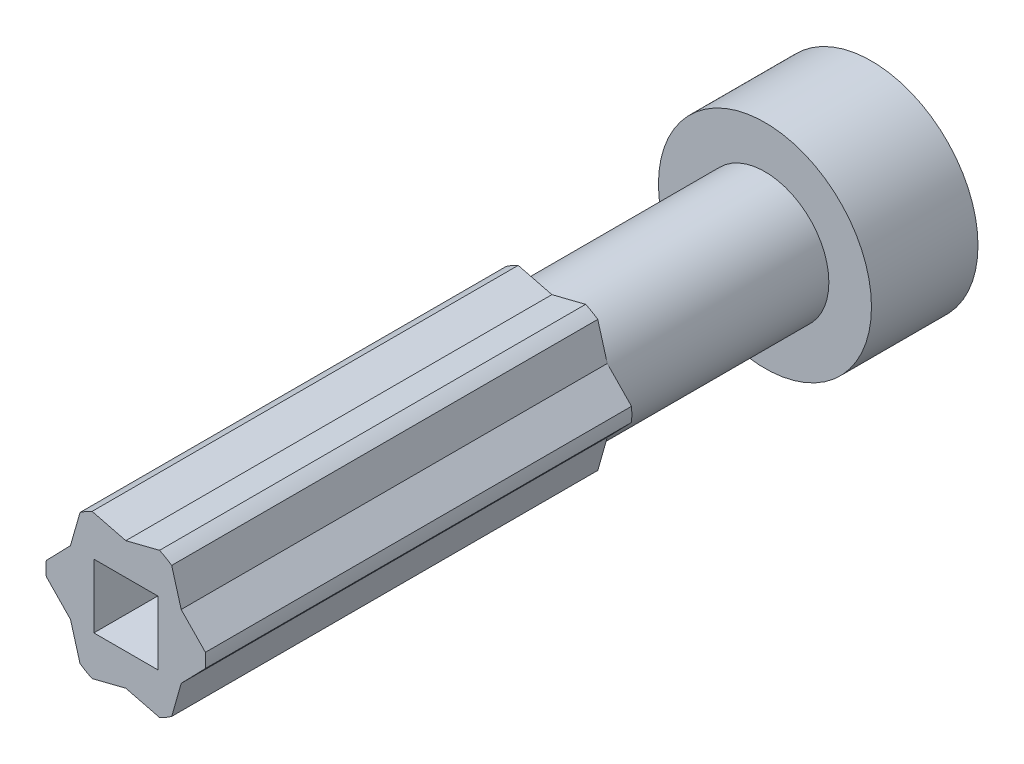
ISO-10303-21;
HEADER;
FILE_DESCRIPTION(('STEP AP214'),'2;1');
FILE_NAME('part.step','',(''),(''),'','','');
FILE_SCHEMA(('AUTOMOTIVE_DESIGN { 1 0 10303 214 1 1 1 1 }'));
ENDSEC;
DATA;
#1=APPLICATION_CONTEXT('core data for automotive mechanical design processes');
#2=APPLICATION_PROTOCOL_DEFINITION('international standard','automotive_design',2000,#1);
#3=PRODUCT_CONTEXT('',#1,'mechanical');
#4=PRODUCT('Part','Part','',(#3));
#5=PRODUCT_RELATED_PRODUCT_CATEGORY('part','',(#4));
#6=PRODUCT_DEFINITION_FORMATION('','',#4);
#7=PRODUCT_DEFINITION_CONTEXT('part definition',#1,'design');
#8=PRODUCT_DEFINITION('design','',#6,#7);
#9=PRODUCT_DEFINITION_SHAPE('','',#8);
#10=(LENGTH_UNIT() NAMED_UNIT(*) SI_UNIT(.MILLI.,.METRE.));
#11=(NAMED_UNIT(*) PLANE_ANGLE_UNIT() SI_UNIT($,.RADIAN.));
#12=(NAMED_UNIT(*) SI_UNIT($,.STERADIAN.) SOLID_ANGLE_UNIT());
#13=UNCERTAINTY_MEASURE_WITH_UNIT(LENGTH_MEASURE(1.E-05),#10,'distance_accuracy_value','');
#14=(GEOMETRIC_REPRESENTATION_CONTEXT(3) GLOBAL_UNCERTAINTY_ASSIGNED_CONTEXT((#13)) GLOBAL_UNIT_ASSIGNED_CONTEXT((#10,
#11,#12)) REPRESENTATION_CONTEXT('',''));
#15=CARTESIAN_POINT('',(0.,0.,0.));
#16=DIRECTION('',(0.,0.,1.));
#17=DIRECTION('',(1.,0.,0.));
#18=AXIS2_PLACEMENT_3D('',#15,#16,#17);
#19=CARTESIAN_POINT('',(0.,0.,38.1));
#20=DIRECTION('',(0.,0.,-1.));
#21=DIRECTION('',(-1.,0.,0.));
#22=AXIS2_PLACEMENT_3D('',#19,#20,#21);
#23=CYLINDRICAL_SURFACE('',#22,3.81);
#24=CARTESIAN_POINT('',(-3.81000000000001,0.,4.7625));
#25=CARTESIAN_POINT('',(-3.80999312126421,-0.0850367268480943,4.76249084953406));
#26=CARTESIAN_POINT('',(-3.80712005877877,-0.170207174271141,4.75562681266925));
#27=CARTESIAN_POINT('',(-3.79590495046034,-0.338134161368688,4.72841438755136));
#28=CARTESIAN_POINT('',(-3.78754863394308,-0.420883812058091,4.70803081193042));
#29=CARTESIAN_POINT('',(-3.76626487078422,-0.581264691739586,4.65466291343867));
#30=CARTESIAN_POINT('',(-3.75335291968253,-0.658912226021491,4.62172127537543));
#31=CARTESIAN_POINT('',(-3.72421513817741,-0.807503790983442,4.54434851449461));
#32=CARTESIAN_POINT('',(-3.70799031187918,-0.878449843320334,4.49992087190698));
#33=CARTESIAN_POINT('',(-3.67293942006872,-1.01529947252067,4.39848119210958));
#34=CARTESIAN_POINT('',(-3.65402816724135,-1.08082240974766,4.34098533783701));
#35=CARTESIAN_POINT('',(-3.61610546867011,-1.20162297278599,4.21606429482612));
#36=CARTESIAN_POINT('',(-3.59709397555649,-1.25689520420451,4.14863391138396));
#37=CARTESIAN_POINT('',(-3.56007697702505,-1.35831246875283,4.00173599249257));
#38=CARTESIAN_POINT('',(-3.54216699329197,-1.40387461355495,3.92183944049829));
#39=CARTESIAN_POINT('',(-3.51073176893393,-1.48074304547866,3.75466196244043));
#40=CARTESIAN_POINT('',(-3.49720427051045,-1.51205667662092,3.66738486805474));
#41=CARTESIAN_POINT('',(-3.47698765342383,-1.55796739856445,3.49230481145473));
#42=CARTESIAN_POINT('',(-3.47000052317766,-1.57329705504567,3.40472968609196));
#43=CARTESIAN_POINT('',(-3.46279884298767,-1.58909016659113,3.22799291828805));
#44=CARTESIAN_POINT('',(-3.4625805580008,-1.58956182029095,3.1388321779673));
#45=CARTESIAN_POINT('',(-3.46868901842282,-1.57617731961875,2.96875192324762));
#46=CARTESIAN_POINT('',(-3.47451531058997,-1.56341675012632,2.88772460736313));
#47=CARTESIAN_POINT('',(-3.49121073122718,-1.52576772590046,2.7290876444295));
#48=CARTESIAN_POINT('',(-3.50208082543526,-1.50087694854724,2.65147865500545));
#49=CARTESIAN_POINT('',(-3.52788454661402,-1.43918887584025,2.49992171720087));
#50=CARTESIAN_POINT('',(-3.54289972075401,-1.4021494885484,2.42608681544));
#51=CARTESIAN_POINT('',(-3.57528280549176,-1.31738678077324,2.2853932779722));
#52=CARTESIAN_POINT('',(-3.59265164284819,-1.26965924695992,2.21853740872083));
#53=CARTESIAN_POINT('',(-3.62957080635033,-1.16013987624077,2.08775305240928));
#54=CARTESIAN_POINT('',(-3.64918144183679,-1.09750032367365,2.02454945942046));
#55=CARTESIAN_POINT('',(-3.68713604852911,-0.962316580635479,1.90930085124181));
#56=CARTESIAN_POINT('',(-3.70547972233803,-0.889770076499569,1.85725844995092));
#57=CARTESIAN_POINT('',(-3.73936620116719,-0.734628894840602,1.76474650400733));
#58=CARTESIAN_POINT('',(-3.75483458510028,-0.651840939708585,1.7245718046586));
#59=CARTESIAN_POINT('',(-3.78065641396805,-0.479872551209143,1.65897415270382));
#60=CARTESIAN_POINT('',(-3.79101268524186,-0.390695681389777,1.63354304743134));
#61=CARTESIAN_POINT('',(-3.80491544306725,-0.214538703949805,1.59967168999916));
#62=CARTESIAN_POINT('',(-3.80885117129848,-0.127776332303962,1.59025862104642));
#63=CARTESIAN_POINT('',(-3.81071183968306,0.0461704124799492,1.58579029601008));
#64=CARTESIAN_POINT('',(-3.8086385055418,0.133354657283765,1.59073091777995));
#65=CARTESIAN_POINT('',(-3.79896646424336,0.301114767773541,1.6141332777037));
#66=CARTESIAN_POINT('',(-3.79164706850677,0.381803867631939,1.63191184170343));
#67=CARTESIAN_POINT('',(-3.77251730600958,0.538966091193194,1.67953460706678));
#68=CARTESIAN_POINT('',(-3.76070637188808,0.615438680878219,1.70938033275687));
#69=CARTESIAN_POINT('',(-3.73327003719348,0.764678429833711,1.78126513915438));
#70=CARTESIAN_POINT('',(-3.71753754165985,0.837256690806187,1.82365419259545));
#71=CARTESIAN_POINT('',(-3.68393731815449,0.974529694613838,1.91903778979545));
#72=CARTESIAN_POINT('',(-3.66606869996292,1.03922112780437,1.97203676144218));
#73=CARTESIAN_POINT('',(-3.62854351627205,1.16374345644821,2.09156710625596));
#74=CARTESIAN_POINT('',(-3.60885043520608,1.22289658643431,2.15879489879255));
#75=CARTESIAN_POINT('',(-3.57104107695369,1.32927070455392,2.30253702043795));
#76=CARTESIAN_POINT('',(-3.55292515846669,1.37648898292725,2.37905345266811));
#77=CARTESIAN_POINT('',(-3.52020360529865,1.45816269465038,2.54078000263427));
#78=CARTESIAN_POINT('',(-3.50565164444989,1.49242676161398,2.62609842510383));
#79=CARTESIAN_POINT('',(-3.48244611686883,1.54581115718489,2.80209065413882));
#80=CARTESIAN_POINT('',(-3.47378768735825,1.56494397276875,2.89275997835385));
#81=CARTESIAN_POINT('',(-3.46409218962342,1.58628182043094,3.069359747983));
#82=CARTESIAN_POINT('',(-3.46251975728299,1.58967653124663,3.15511772111162));
#83=CARTESIAN_POINT('',(-3.46575193324004,1.58261780915361,3.3259304336492));
#84=CARTESIAN_POINT('',(-3.47055556256207,1.57216650215195,3.41098527899839));
#85=CARTESIAN_POINT('',(-3.48550930153897,1.53871174071222,3.57389778928549));
#86=CARTESIAN_POINT('',(-3.49540010655033,1.51631527535753,3.65190617529851));
#87=CARTESIAN_POINT('',(-3.51921040122973,1.46019936816699,3.80307598712368));
#88=CARTESIAN_POINT('',(-3.53313102277267,1.42647674466902,3.87623604405646));
#89=CARTESIAN_POINT('',(-3.56447032291236,1.34633063138065,4.02043378785539));
#90=CARTESIAN_POINT('',(-3.58204900446381,1.29926538356304,4.09107935931373));
#91=CARTESIAN_POINT('',(-3.61827685098373,1.19466877224048,4.22384237698807));
#92=CARTESIAN_POINT('',(-3.63692638559259,1.13713377971004,4.28595685301273));
#93=CARTESIAN_POINT('',(-3.67482618919634,1.00825559813903,4.40454882573961));
#94=CARTESIAN_POINT('',(-3.69402128239975,0.936211919735194,4.46028626970758));
#95=CARTESIAN_POINT('',(-3.72948382399967,0.783082100651522,4.55891830600037));
#96=CARTESIAN_POINT('',(-3.74574993694262,0.701991862391085,4.60180704590974));
#97=CARTESIAN_POINT('',(-3.77328662870322,0.534329712031779,4.67259650370867));
#98=CARTESIAN_POINT('',(-3.78463533879085,0.447870568545354,4.70073325360396));
#99=CARTESIAN_POINT('',(-3.80137682406163,0.271031235745041,4.74180703792882));
#100=CARTESIAN_POINT('',(-3.80678824381231,0.180664252565729,4.75479166201294));
#101=CARTESIAN_POINT('',(-3.80964805212561,0.0599898240372968,4.76165311457979));
#102=CARTESIAN_POINT('',(-3.81000242700227,0.030003235238051,4.76250322852952));
#103=CARTESIAN_POINT('',(-3.81000000000001,0.,4.7625));
#104=B_SPLINE_CURVE_WITH_KNOTS('',3,(#24,#25,#26,#27,#28,#29,#30,#31,#32,#33,#34,#35,#36,#37,
#38,#39,#40,#41,#42,#43,#44,#45,#46,#47,#48,#49,#50,#51,#52,#53,#54,#55,#56,#57,#58,#59,#60,#61,
#62,#63,#64,#65,#66,#67,#68,#69,#70,#71,#72,#73,#74,#75,#76,#77,#78,#79,#80,#81,#82,#83,#84,#85,
#86,#87,#88,#89,#90,#91,#92,#93,#94,#95,#96,#97,#98,#99,#100,#101,#102,#103),.UNSPECIFIED.,.T.,
.F.,(4,2,2,2,2,2,2,2,2,2,2,2,2,2,2,2,2,2,2,2,2,2,2,2,2,2,2,2,2,2,2,2,2,2,2,2,2,2,2,4),(0.,
0.255024786982704,0.51071594659862,0.765545651921126,1.02029823480337,1.28673779086796,
1.55331716426972,1.83301290164697,2.11256431347854,2.37864996884707,2.64458879576298,
2.89014099647255,3.13574023253568,3.38656565584576,3.63749013060861,3.90962059232441,
4.18181471629543,4.46029149927247,4.73861414757248,4.9993352310944,5.25998144716339,
5.50769268964378,5.75543523284281,6.01087361795658,6.26641882946272,6.54022679797216,
6.81409687775246,7.09186781216606,7.36940927784728,7.62558644500758,7.88172428347881,
8.12593815455259,8.37022068587291,8.62919144614762,8.88825214250958,9.16618099456213,
9.44423624774301,9.71769526890627,9.9902930809605,10.0802726575386),.UNSPECIFIED.);
#105=CARTESIAN_POINT('',(-3.81000000000001,0.,4.7625));
#106=VERTEX_POINT('',#105);
#107=EDGE_CURVE('E347',#106,#106,#104,.T.);
#108=ORIENTED_EDGE('',*,*,#107,.T.);
#109=EDGE_LOOP('',(#108));
#110=FACE_BOUND('',#109,.T.);
#111=CARTESIAN_POINT('',(0.,0.,12.7));
#112=DIRECTION('',(0.,0.,1.));
#113=DIRECTION('',(1.,0.,0.));
#114=AXIS2_PLACEMENT_3D('',#111,#112,#113);
#115=CIRCLE('',#114,3.81);
#116=CARTESIAN_POINT('',(-3.29709075963902,-1.90926491684748,12.7));
#117=VERTEX_POINT('',#116);
#118=CARTESIAN_POINT('',(0.00199791969690555,-3.80999947615707,12.7));
#119=VERTEX_POINT('',#118);
#120=EDGE_CURVE('E145',#117,#119,#115,.T.);
#121=ORIENTED_EDGE('',*,*,#120,.F.);
#122=DIRECTION('',(0.,0.,1.));
#123=VECTOR('',#122,1.);
#124=CARTESIAN_POINT('',(-3.29709075963902,-1.90926491684748,12.7));
#125=LINE('',#124,#123);
#126=CARTESIAN_POINT('',(-3.29709075963902,-1.90926491684749,38.1));
#127=VERTEX_POINT('',#126);
#128=EDGE_CURVE('E149',#117,#127,#125,.T.);
#129=ORIENTED_EDGE('',*,*,#128,.T.);
#130=CARTESIAN_POINT('',(0.,0.,38.1));
#131=DIRECTION('',(0.,0.,1.));
#132=DIRECTION('',(1.,0.,0.));
#133=AXIS2_PLACEMENT_3D('',#130,#131,#132);
#134=CIRCLE('',#133,3.81);
#135=CARTESIAN_POINT('',(-3.30052497881844,-1.90332206002987,38.1));
#136=VERTEX_POINT('',#135);
#137=EDGE_CURVE('E138',#136,#127,#134,.T.);
#138=ORIENTED_EDGE('',*,*,#137,.F.);
#139=DIRECTION('',(0.,0.,1.));
#140=VECTOR('',#139,1.);
#141=CARTESIAN_POINT('',(-3.30052497881836,-1.90332206002987,12.7));
#142=LINE('',#141,#140);
#143=CARTESIAN_POINT('',(-3.30052497881836,-1.90332206002987,12.7));
#144=VERTEX_POINT('',#143);
#145=EDGE_CURVE('E379',#144,#136,#142,.T.);
#146=ORIENTED_EDGE('',*,*,#145,.F.);
#147=CARTESIAN_POINT('',(0.,0.,12.7));
#148=DIRECTION('',(0.,0.,1.));
#149=DIRECTION('',(1.,0.,0.));
#150=AXIS2_PLACEMENT_3D('',#147,#148,#149);
#151=CIRCLE('',#150,3.81);
#152=CARTESIAN_POINT('',(-3.30152059995389,1.90159452252039,12.7));
#153=VERTEX_POINT('',#152);
#154=EDGE_CURVE('E360',#153,#144,#151,.T.);
#155=ORIENTED_EDGE('',*,*,#154,.F.);
#156=DIRECTION('',(0.,0.,1.));
#157=VECTOR('',#156,1.);
#158=CARTESIAN_POINT('',(-3.30152059995389,1.90159452252039,12.7));
#159=LINE('',#158,#157);
#160=CARTESIAN_POINT('',(-3.30152059995389,1.90159452252039,38.1));
#161=VERTEX_POINT('',#160);
#162=EDGE_CURVE('E374',#153,#161,#159,.T.);
#163=ORIENTED_EDGE('',*,*,#162,.T.);
#164=CARTESIAN_POINT('',(-3.2980884589896,1.90754096068221,38.1));
#165=VERTEX_POINT('',#164);
#166=EDGE_CURVE('E12',#165,#161,#134,.T.);
#167=ORIENTED_EDGE('',*,*,#166,.F.);
#168=DIRECTION('',(0.,0.,1.));
#169=VECTOR('',#168,1.);
#170=CARTESIAN_POINT('',(-3.2980884589896,1.90754096068226,12.7));
#171=LINE('',#170,#169);
#172=CARTESIAN_POINT('',(-3.2980884589896,1.90754096068226,12.7));
#173=VERTEX_POINT('',#172);
#174=EDGE_CURVE('E506',#173,#165,#171,.T.);
#175=ORIENTED_EDGE('',*,*,#174,.F.);
#176=CARTESIAN_POINT('',(0.,0.,12.7));
#177=DIRECTION('',(0.,0.,1.));
#178=DIRECTION('',(1.,0.,0.));
#179=AXIS2_PLACEMENT_3D('',#176,#177,#178);
#180=CIRCLE('',#179,3.81);
#181=CARTESIAN_POINT('',(1.94289029309402E-13,3.80999999999998,12.7));
#182=VERTEX_POINT('',#181);
#183=EDGE_CURVE('E487',#182,#173,#180,.T.);
#184=ORIENTED_EDGE('',*,*,#183,.F.);
#185=CARTESIAN_POINT('',(0.,0.,12.7));
#186=DIRECTION('',(0.,0.,1.));
#187=DIRECTION('',(1.,0.,0.));
#188=AXIS2_PLACEMENT_3D('',#185,#186,#187);
#189=CIRCLE('',#188,3.81);
#190=EDGE_CURVE('E458',#119,#182,#189,.T.);
#191=ORIENTED_EDGE('',*,*,#190,.F.);
#192=EDGE_LOOP('',(#121,#129,#138,#146,#155,#163,#167,#175,#184,#191));
#193=FACE_BOUND('',#192,.T.);
#194=CARTESIAN_POINT('',(0.,0.,0.));
#195=DIRECTION('',(0.,0.,1.));
#196=DIRECTION('',(1.,0.,0.));
#197=AXIS2_PLACEMENT_3D('',#194,#195,#196);
#198=CIRCLE('',#197,3.81);
#199=CARTESIAN_POINT('',(3.81000000000001,0.,0.));
#200=VERTEX_POINT('',#199);
#201=EDGE_CURVE('E132',#200,#200,#198,.T.);
#202=ORIENTED_EDGE('',*,*,#201,.T.);
#203=EDGE_LOOP('',(#202));
#204=FACE_BOUND('',#203,.T.);
#205=ADVANCED_FACE('F128',(#110,#193,#204),#23,.T.);
#206=CARTESIAN_POINT('',(0.,0.,38.1));
#207=DIRECTION('',(0.,0.,1.));
#208=DIRECTION('',(1.,0.,0.));
#209=AXIS2_PLACEMENT_3D('',#206,#207,#208);
#210=PLANE('',#209);
#211=DIRECTION('',(-1.,0.,0.));
#212=VECTOR('',#211,1.);
#213=CARTESIAN_POINT('',(-1.90499999999999,1.90499999999988,38.1));
#214=LINE('',#213,#212);
#215=CARTESIAN_POINT('',(1.90499999999982,1.90499999999988,38.1));
#216=VERTEX_POINT('',#215);
#217=CARTESIAN_POINT('',(-1.90499999999999,1.90499999999988,38.1));
#218=VERTEX_POINT('',#217);
#219=EDGE_CURVE('E523',#216,#218,#214,.T.);
#220=ORIENTED_EDGE('',*,*,#219,.F.);
#221=DIRECTION('',(0.,1.,0.));
#222=VECTOR('',#221,1.);
#223=CARTESIAN_POINT('',(1.90499999999982,1.90499999999988,38.1));
#224=LINE('',#223,#222);
#225=CARTESIAN_POINT('',(1.90499999999999,-1.90500000000011,38.1));
#226=VERTEX_POINT('',#225);
#227=EDGE_CURVE('E505',#226,#216,#224,.T.);
#228=ORIENTED_EDGE('',*,*,#227,.F.);
#229=DIRECTION('',(1.,0.,0.));
#230=VECTOR('',#229,1.);
#231=CARTESIAN_POINT('',(-1.90500000000018,-1.90500000000009,38.1));
#232=LINE('',#231,#230);
#233=CARTESIAN_POINT('',(-1.90500000000018,-1.90500000000009,38.1));
#234=VERTEX_POINT('',#233);
#235=EDGE_CURVE('E515',#234,#226,#232,.T.);
#236=ORIENTED_EDGE('',*,*,#235,.F.);
#237=DIRECTION('',(0.,-1.,0.));
#238=VECTOR('',#237,1.);
#239=CARTESIAN_POINT('',(-1.90499999999999,1.90499999999988,38.1));
#240=LINE('',#239,#238);
#241=EDGE_CURVE('E519',#218,#234,#240,.T.);
#242=ORIENTED_EDGE('',*,*,#241,.F.);
#243=EDGE_LOOP('',(#220,#228,#236,#242));
#244=FACE_BOUND('',#243,.T.);
#245=ORIENTED_EDGE('',*,*,#166,.T.);
#246=DIRECTION('',(-0.696336997840871,-0.717714975068773,0.));
#247=VECTOR('',#246,1.);
#248=CARTESIAN_POINT('',(-2.65102480534721,2.57206094101647,38.1));
#249=LINE('',#248,#247);
#250=CARTESIAN_POINT('',(-4.74224008452151,0.416644057223081,38.1));
#251=VERTEX_POINT('',#250);
#252=EDGE_CURVE('E335',#161,#251,#249,.T.);
#253=ORIENTED_EDGE('',*,*,#252,.T.);
#254=CARTESIAN_POINT('',(0.002000000000002,-1.2490009027033E-13,38.1));
#255=DIRECTION('',(0.,0.,1.));
#256=DIRECTION('',(1.,0.,0.));
#257=AXIS2_PLACEMENT_3D('',#254,#255,#256);
#258=CIRCLE('',#257,4.7625);
#259=CARTESIAN_POINT('',(-4.74217229163329,-0.417415281583192,38.1));
#260=VERTEX_POINT('',#259);
#261=EDGE_CURVE('E367',#251,#260,#258,.T.);
#262=ORIENTED_EDGE('',*,*,#261,.T.);
#263=DIRECTION('',(-0.696336997840849,0.717714975068795,0.));
#264=VECTOR('',#263,1.);
#265=CARTESIAN_POINT('',(-2.65137532017654,-2.57240101535289,38.1));
#266=LINE('',#265,#264);
#267=EDGE_CURVE('E353',#136,#260,#266,.T.);
#268=ORIENTED_EDGE('',*,*,#267,.F.);
#269=ORIENTED_EDGE('',*,*,#137,.T.);
#270=DIRECTION('',(0.273390902165641,-0.961903017259569,0.));
#271=VECTOR('',#270,1.);
#272=CARTESIAN_POINT('',(-3.55274763246094,-1.00975759819595,38.1));
#273=LINE('',#272,#271);
#274=CARTESIAN_POINT('',(-2.73144438015185,-3.8994443808327,38.1));
#275=VERTEX_POINT('',#274);
#276=EDGE_CURVE('E336',#127,#275,#273,.T.);
#277=ORIENTED_EDGE('',*,*,#276,.T.);
#278=CARTESIAN_POINT('',(0.00150000000001538,0.000866025403667425,38.1));
#279=DIRECTION('',(0.,0.,1.));
#280=DIRECTION('',(1.,0.,0.));
#281=AXIS2_PLACEMENT_3D('',#278,#279,#280);
#282=CIRCLE('',#281,4.7625);
#283=CARTESIAN_POINT('',(-2.00909390803788,-4.31641533987244,38.1));
#284=VERTEX_POINT('',#283);
#285=EDGE_CURVE('E319',#275,#284,#282,.T.);
#286=ORIENTED_EDGE('',*,*,#285,.T.);
#287=DIRECTION('',(-0.969727900006514,-0.244188042190771,0.));
#288=VECTOR('',#287,1.);
#289=CARTESIAN_POINT('',(0.902311853142684,-3.5832916741093,38.1));
#290=LINE('',#289,#288);
#291=CARTESIAN_POINT('',(0.00200208899439613,-3.80999947396854,38.1));
#292=VERTEX_POINT('',#291);
#293=EDGE_CURVE('E310',#292,#284,#290,.T.);
#294=ORIENTED_EDGE('',*,*,#293,.F.);
#295=DIRECTION('',(0.969727900006509,-0.244188042190791,0.));
#296=VECTOR('',#295,1.);
#297=CARTESIAN_POINT('',(-0.90207334194331,-3.58234449027982,38.1));
#298=LINE('',#297,#296);
#299=CARTESIAN_POINT('',(2.01179570436946,-4.31608843805595,38.1));
#300=VERTEX_POINT('',#299);
#301=EDGE_CURVE('E290',#292,#300,#298,.T.);
#302=ORIENTED_EDGE('',*,*,#301,.T.);
#303=CARTESIAN_POINT('',(0.000499999999986622,0.000866025403653548,38.1));
#304=DIRECTION('',(0.,0.,1.));
#305=DIRECTION('',(1.,0.,0.));
#306=AXIS2_PLACEMENT_3D('',#303,#304,#305);
#307=CIRCLE('',#306,4.7625);
#308=CARTESIAN_POINT('',(2.73407838359524,-3.89900005828946,38.1));
#309=VERTEX_POINT('',#308);
#310=EDGE_CURVE('E302',#300,#309,#307,.T.);
#311=ORIENTED_EDGE('',*,*,#310,.T.);
#312=DIRECTION('',(-0.27339090216566,-0.961903017259563,0.));
#313=VECTOR('',#312,1.);
#314=CARTESIAN_POINT('',(3.55506791771912,-1.01041706684162,38.1));
#315=LINE('',#314,#313);
#316=CARTESIAN_POINT('',(3.30105678841852,-1.90413397459634,38.1));
#317=VERTEX_POINT('',#316);
#318=EDGE_CURVE('E407',#317,#309,#315,.T.);
#319=ORIENTED_EDGE('',*,*,#318,.F.);
#320=DIRECTION('',(0.696336997840863,0.71771497506878,0.));
#321=VECTOR('',#320,1.);
#322=CARTESIAN_POINT('',(2.65205503491775,-2.57306048399861,38.1));
#323=LINE('',#322,#321);
#324=CARTESIAN_POINT('',(4.74424008452132,-0.416644057223234,38.1));
#325=VERTEX_POINT('',#324);
#326=EDGE_CURVE('E427',#317,#325,#323,.T.);
#327=ORIENTED_EDGE('',*,*,#326,.T.);
#328=CARTESIAN_POINT('',(0.,0.,38.1));
#329=DIRECTION('',(0.,0.,1.));
#330=DIRECTION('',(1.,0.,0.));
#331=AXIS2_PLACEMENT_3D('',#328,#329,#330);
#332=CIRCLE('',#331,4.7625);
#333=CARTESIAN_POINT('',(4.74417229163326,0.417415281583067,38.1));
#334=VERTEX_POINT('',#333);
#335=EDGE_CURVE('E422',#325,#334,#332,.T.);
#336=ORIENTED_EDGE('',*,*,#335,.T.);
#337=DIRECTION('',(0.696336997840856,-0.717714975068787,0.));
#338=VECTOR('',#337,1.);
#339=CARTESIAN_POINT('',(2.65240554974699,2.57340055833484,38.1));
#340=LINE('',#339,#338);
#341=CARTESIAN_POINT('',(3.30005678841852,1.90586602540373,38.1));
#342=VERTEX_POINT('',#341);
#343=EDGE_CURVE('E391',#342,#334,#340,.T.);
#344=ORIENTED_EDGE('',*,*,#343,.F.);
#345=DIRECTION('',(-0.27339090216565,0.961903017259567,0.));
#346=VECTOR('',#345,1.);
#347=CARTESIAN_POINT('',(3.55459814729017,1.01028354926311,38.1));
#348=LINE('',#347,#346);
#349=CARTESIAN_POINT('',(2.73344438015183,3.89944438083266,38.1));
#350=VERTEX_POINT('',#349);
#351=EDGE_CURVE('E442',#342,#350,#348,.T.);
#352=ORIENTED_EDGE('',*,*,#351,.T.);
#353=CARTESIAN_POINT('',(0.000499999999820089,-0.000866025403820081,38.1));
#354=DIRECTION('',(0.,0.,1.));
#355=DIRECTION('',(1.,0.,0.));
#356=AXIS2_PLACEMENT_3D('',#353,#354,#355);
#357=CIRCLE('',#356,4.7625);
#358=CARTESIAN_POINT('',(2.01109390803783,4.31641533987237,38.1));
#359=VERTEX_POINT('',#358);
#360=EDGE_CURVE('E303',#350,#359,#357,.T.);
#361=ORIENTED_EDGE('',*,*,#360,.T.);
#362=DIRECTION('',(0.969727900006511,0.244188042190781,0.));
#363=VECTOR('',#362,1.);
#364=CARTESIAN_POINT('',(-0.902192597543011,3.58281808219441,38.1));
#365=LINE('',#364,#363);
#366=CARTESIAN_POINT('',(0.,3.80999999999997,38.1));
#367=VERTEX_POINT('',#366);
#368=EDGE_CURVE('E314',#367,#359,#365,.T.);
#369=ORIENTED_EDGE('',*,*,#368,.F.);
#370=DIRECTION('',(-0.969727900006511,0.244188042190781,0.));
#371=VECTOR('',#370,1.);
#372=CARTESIAN_POINT('',(0.902192597542983,3.58281808219441,38.1));
#373=LINE('',#372,#371);
#374=CARTESIAN_POINT('',(-2.01016830492518,4.31618226293196,38.1));
#375=VERTEX_POINT('',#374);
#376=EDGE_CURVE('E426',#367,#375,#373,.T.);
#377=ORIENTED_EDGE('',*,*,#376,.T.);
#378=CARTESIAN_POINT('',(0.00149999999998762,-0.000866025403806203,38.1));
#379=DIRECTION('',(0.,0.,1.));
#380=DIRECTION('',(1.,0.,0.));
#381=AXIS2_PLACEMENT_3D('',#378,#379,#380);
#382=CIRCLE('',#381,4.76274241302873);
#383=CARTESIAN_POINT('',(-2.73197331703987,3.89936972617494,38.1));
#384=VERTEX_POINT('',#383);
#385=EDGE_CURVE('E494',#375,#384,#382,.T.);
#386=ORIENTED_EDGE('',*,*,#385,.T.);
#387=DIRECTION('',(0.27339090216567,0.961903017259561,0.));
#388=VECTOR('',#387,1.);
#389=CARTESIAN_POINT('',(-3.55321740289008,1.00989111577422,38.1));
#390=LINE('',#389,#388);
#391=EDGE_CURVE('E480',#165,#384,#390,.T.);
#392=ORIENTED_EDGE('',*,*,#391,.F.);
#393=EDGE_LOOP('',(#245,#253,#262,#268,#269,#277,#286,#294,#302,#311,#319,#327,#336,#344,#352,
#361,#369,#377,#386,#392));
#394=FACE_BOUND('',#393,.T.);
#395=ADVANCED_FACE('F316',(#244,#394),#210,.T.);
#396=CARTESIAN_POINT('',(0.,0.,-6.34999999999999));
#397=DIRECTION('',(0.,0.,1.));
#398=DIRECTION('',(1.,0.,0.));
#399=AXIS2_PLACEMENT_3D('',#396,#397,#398);
#400=CYLINDRICAL_SURFACE('',#399,6.35);
#401=CARTESIAN_POINT('',(0.,0.,-6.34999999999999));
#402=DIRECTION('',(0.,0.,-1.));
#403=DIRECTION('',(-1.,0.,0.));
#404=AXIS2_PLACEMENT_3D('',#401,#402,#403);
#405=CIRCLE('',#404,6.35);
#406=CARTESIAN_POINT('',(-6.35000000000002,0.,-6.34999999999999));
#407=VERTEX_POINT('',#406);
#408=EDGE_CURVE('E559',#407,#407,#405,.T.);
#409=ORIENTED_EDGE('',*,*,#408,.F.);
#410=EDGE_LOOP('',(#409));
#411=FACE_BOUND('',#410,.T.);
#412=CARTESIAN_POINT('',(0.,0.,0.));
#413=DIRECTION('',(0.,0.,-1.));
#414=DIRECTION('',(-1.,0.,0.));
#415=AXIS2_PLACEMENT_3D('',#412,#413,#414);
#416=CIRCLE('',#415,6.35);
#417=CARTESIAN_POINT('',(-6.35000000000002,0.,0.));
#418=VERTEX_POINT('',#417);
#419=EDGE_CURVE('E558',#418,#418,#416,.T.);
#420=ORIENTED_EDGE('',*,*,#419,.T.);
#421=EDGE_LOOP('',(#420));
#422=FACE_BOUND('',#421,.T.);
#423=ADVANCED_FACE('F568',(#411,#422),#400,.T.);
#424=CARTESIAN_POINT('',(0.,0.,-6.34999999999999));
#425=DIRECTION('',(0.,0.,-1.));
#426=DIRECTION('',(-1.,0.,0.));
#427=AXIS2_PLACEMENT_3D('',#424,#425,#426);
#428=PLANE('',#427);
#429=ORIENTED_EDGE('',*,*,#408,.T.);
#430=EDGE_LOOP('',(#429));
#431=FACE_BOUND('',#430,.T.);
#432=ADVANCED_FACE('F573',(#431),#428,.T.);
#433=CARTESIAN_POINT('',(0.,0.,0.));
#434=DIRECTION('',(0.,0.,-1.));
#435=DIRECTION('',(-1.,0.,0.));
#436=AXIS2_PLACEMENT_3D('',#433,#434,#435);
#437=PLANE('',#436);
#438=ORIENTED_EDGE('',*,*,#201,.F.);
#439=EDGE_LOOP('',(#438));
#440=FACE_BOUND('',#439,.T.);
#441=ORIENTED_EDGE('',*,*,#419,.F.);
#442=EDGE_LOOP('',(#441));
#443=FACE_BOUND('',#442,.T.);
#444=ADVANCED_FACE('F570',(#440,#443),#437,.F.);
#445=CARTESIAN_POINT('',(0.,0.,0.));
#446=DIRECTION('',(0.,0.,-1.));
#447=DIRECTION('',(-1.,0.,0.));
#448=AXIS2_PLACEMENT_3D('',#445,#446,#447);
#449=PLANE('',#448);
#450=DIRECTION('',(0.,1.,0.));
#451=VECTOR('',#450,1.);
#452=CARTESIAN_POINT('',(1.90499999999982,1.90499999999989,0.));
#453=LINE('',#452,#451);
#454=CARTESIAN_POINT('',(1.90499999999999,-1.9050000000001,0.));
#455=VERTEX_POINT('',#454);
#456=CARTESIAN_POINT('',(1.90499999999982,1.90499999999989,0.));
#457=VERTEX_POINT('',#456);
#458=EDGE_CURVE('E534',#455,#457,#453,.T.);
#459=ORIENTED_EDGE('',*,*,#458,.T.);
#460=DIRECTION('',(-1.,0.,0.));
#461=VECTOR('',#460,1.);
#462=CARTESIAN_POINT('',(-1.90499999999999,1.90499999999991,0.));
#463=LINE('',#462,#461);
#464=CARTESIAN_POINT('',(-1.90499999999999,1.90499999999991,0.));
#465=VERTEX_POINT('',#464);
#466=EDGE_CURVE('E518',#457,#465,#463,.T.);
#467=ORIENTED_EDGE('',*,*,#466,.T.);
#468=DIRECTION('',(0.,-1.,0.));
#469=VECTOR('',#468,1.);
#470=CARTESIAN_POINT('',(-1.90499999999999,1.90499999999991,0.));
#471=LINE('',#470,#469);
#472=CARTESIAN_POINT('',(-1.90500000000007,-1.90500000000009,0.));
#473=VERTEX_POINT('',#472);
#474=EDGE_CURVE('E545',#465,#473,#471,.T.);
#475=ORIENTED_EDGE('',*,*,#474,.T.);
#476=DIRECTION('',(1.,0.,0.));
#477=VECTOR('',#476,1.);
#478=CARTESIAN_POINT('',(-1.90500000000007,-1.90500000000009,0.));
#479=LINE('',#478,#477);
#480=EDGE_CURVE('E540',#473,#455,#479,.T.);
#481=ORIENTED_EDGE('',*,*,#480,.T.);
#482=EDGE_LOOP('',(#459,#467,#475,#481));
#483=FACE_BOUND('',#482,.T.);
#484=ADVANCED_FACE('F572',(#483),#449,.F.);
#485=CARTESIAN_POINT('',(-1.90499999999999,1.90499999999988,-5.38815367264148));
#486=DIRECTION('',(0.,1.,0.));
#487=DIRECTION('',(0.,0.,1.));
#488=AXIS2_PLACEMENT_3D('',#485,#486,#487);
#489=PLANE('',#488);
#490=DIRECTION('',(0.,0.,1.));
#491=VECTOR('',#490,1.);
#492=CARTESIAN_POINT('',(1.90499999999982,1.90499999999988,-5.38815367264148));
#493=LINE('',#492,#491);
#494=EDGE_CURVE('E538',#457,#216,#493,.T.);
#495=ORIENTED_EDGE('',*,*,#494,.T.);
#496=ORIENTED_EDGE('',*,*,#219,.T.);
#497=DIRECTION('',(0.,0.,1.));
#498=VECTOR('',#497,1.);
#499=CARTESIAN_POINT('',(-1.90499999999999,1.90499999999988,-5.38815367264148));
#500=LINE('',#499,#498);
#501=EDGE_CURVE('E533',#465,#218,#500,.T.);
#502=ORIENTED_EDGE('',*,*,#501,.F.);
#503=ORIENTED_EDGE('',*,*,#466,.F.);
#504=EDGE_LOOP('',(#495,#496,#502,#503));
#505=FACE_BOUND('',#504,.T.);
#506=ADVANCED_FACE('F580',(#505),#489,.F.);
#507=CARTESIAN_POINT('',(-1.90499999999999,1.90499999999988,-5.38815367264148));
#508=DIRECTION('',(-1.,0.,0.));
#509=DIRECTION('',(0.,-1.,0.));
#510=AXIS2_PLACEMENT_3D('',#507,#508,#509);
#511=PLANE('',#510);
#512=CARTESIAN_POINT('',(-1.90500000000018,-1.2490009027033E-13,3.17500000000001));
#513=DIRECTION('',(1.,0.,0.));
#514=DIRECTION('',(0.,1.,0.));
#515=AXIS2_PLACEMENT_3D('',#512,#513,#514);
#516=CIRCLE('',#515,1.5875);
#517=CARTESIAN_POINT('',(-1.90500000000018,1.58749999999988,3.17500000000001));
#518=VERTEX_POINT('',#517);
#519=EDGE_CURVE('E620',#518,#518,#516,.T.);
#520=ORIENTED_EDGE('',*,*,#519,.F.);
#521=EDGE_LOOP('',(#520));
#522=FACE_BOUND('',#521,.T.);
#523=ORIENTED_EDGE('',*,*,#501,.T.);
#524=ORIENTED_EDGE('',*,*,#241,.T.);
#525=DIRECTION('',(0.,0.,1.));
#526=VECTOR('',#525,1.);
#527=CARTESIAN_POINT('',(-1.90500000000002,-1.90500000000003,-5.3881536726415));
#528=LINE('',#527,#526);
#529=EDGE_CURVE('E544',#473,#234,#528,.T.);
#530=ORIENTED_EDGE('',*,*,#529,.F.);
#531=ORIENTED_EDGE('',*,*,#474,.F.);
#532=EDGE_LOOP('',(#523,#524,#530,#531));
#533=FACE_BOUND('',#532,.T.);
#534=ADVANCED_FACE('F713',(#522,#533),#511,.F.);
#535=CARTESIAN_POINT('',(-1.90500000000002,-1.90500000000003,-5.3881536726415));
#536=DIRECTION('',(0.,-1.,0.));
#537=DIRECTION('',(0.,0.,-1.));
#538=AXIS2_PLACEMENT_3D('',#535,#536,#537);
#539=PLANE('',#538);
#540=ORIENTED_EDGE('',*,*,#529,.T.);
#541=ORIENTED_EDGE('',*,*,#235,.T.);
#542=DIRECTION('',(0.,0.,1.));
#543=VECTOR('',#542,1.);
#544=CARTESIAN_POINT('',(1.90499999999999,-1.90500000000011,-5.3881536726415));
#545=LINE('',#544,#543);
#546=EDGE_CURVE('E539',#455,#226,#545,.T.);
#547=ORIENTED_EDGE('',*,*,#546,.F.);
#548=ORIENTED_EDGE('',*,*,#480,.F.);
#549=EDGE_LOOP('',(#540,#541,#547,#548));
#550=FACE_BOUND('',#549,.T.);
#551=ADVANCED_FACE('F709',(#550),#539,.F.);
#552=CARTESIAN_POINT('',(1.90499999999982,1.90499999999988,-5.38815367264148));
#553=DIRECTION('',(1.,0.,0.));
#554=DIRECTION('',(0.,1.,0.));
#555=AXIS2_PLACEMENT_3D('',#552,#553,#554);
#556=PLANE('',#555);
#557=ORIENTED_EDGE('',*,*,#546,.T.);
#558=ORIENTED_EDGE('',*,*,#227,.T.);
#559=ORIENTED_EDGE('',*,*,#494,.F.);
#560=ORIENTED_EDGE('',*,*,#458,.F.);
#561=EDGE_LOOP('',(#557,#558,#559,#560));
#562=FACE_BOUND('',#561,.T.);
#563=ADVANCED_FACE('F705',(#562),#556,.F.);
#564=CARTESIAN_POINT('',(0.902192597542983,3.58281808219441,12.7));
#565=DIRECTION('',(0.244188042190781,0.969727900006511,0.));
#566=DIRECTION('',(-0.969727900006511,0.244188042190781,0.));
#567=AXIS2_PLACEMENT_3D('',#564,#565,#566);
#568=PLANE('',#567);
#569=ORIENTED_EDGE('',*,*,#376,.F.);
#570=DIRECTION('',(0.,0.,1.));
#571=VECTOR('',#570,1.);
#572=CARTESIAN_POINT('',(1.94289029309402E-13,3.80999999999998,12.7));
#573=LINE('',#572,#571);
#574=EDGE_CURVE('E501',#182,#367,#573,.T.);
#575=ORIENTED_EDGE('',*,*,#574,.F.);
#576=DIRECTION('',(-0.969727900006511,0.244188042190781,0.));
#577=VECTOR('',#576,1.);
#578=CARTESIAN_POINT('',(0.902192597542983,3.58281808219441,12.7));
#579=LINE('',#578,#577);
#580=CARTESIAN_POINT('',(-2.01016830492518,4.31618226293197,12.7));
#581=VERTEX_POINT('',#580);
#582=EDGE_CURVE('E475',#182,#581,#579,.T.);
#583=ORIENTED_EDGE('',*,*,#582,.T.);
#584=DIRECTION('',(0.,0.,1.));
#585=VECTOR('',#584,1.);
#586=CARTESIAN_POINT('',(-2.01016830492518,4.31618226293197,12.7));
#587=LINE('',#586,#585);
#588=EDGE_CURVE('E490',#581,#375,#587,.T.);
#589=ORIENTED_EDGE('',*,*,#588,.T.);
#590=EDGE_LOOP('',(#569,#575,#583,#589));
#591=FACE_BOUND('',#590,.T.);
#592=ADVANCED_FACE('F698',(#591),#568,.T.);
#593=CARTESIAN_POINT('',(-3.55321740289008,1.00989111577422,12.7));
#594=DIRECTION('',(0.961903017259561,-0.27339090216567,0.));
#595=DIRECTION('',(0.27339090216567,0.961903017259561,0.));
#596=AXIS2_PLACEMENT_3D('',#593,#594,#595);
#597=PLANE('',#596);
#598=ORIENTED_EDGE('',*,*,#391,.T.);
#599=DIRECTION('',(0.,0.,1.));
#600=VECTOR('',#599,1.);
#601=CARTESIAN_POINT('',(-2.73197331703987,3.89936972617502,12.7));
#602=LINE('',#601,#600);
#603=CARTESIAN_POINT('',(-2.73197331703987,3.89936972617502,12.7));
#604=VERTEX_POINT('',#603);
#605=EDGE_CURVE('E510',#604,#384,#602,.T.);
#606=ORIENTED_EDGE('',*,*,#605,.F.);
#607=DIRECTION('',(0.27339090216567,0.961903017259561,0.));
#608=VECTOR('',#607,1.);
#609=CARTESIAN_POINT('',(-3.55321740289008,1.00989111577422,12.7));
#610=LINE('',#609,#608);
#611=EDGE_CURVE('E484',#173,#604,#610,.T.);
#612=ORIENTED_EDGE('',*,*,#611,.F.);
#613=ORIENTED_EDGE('',*,*,#174,.T.);
#614=EDGE_LOOP('',(#598,#606,#612,#613));
#615=FACE_BOUND('',#614,.T.);
#616=ADVANCED_FACE('F695',(#615),#597,.F.);
#617=CARTESIAN_POINT('',(0.00150000000001538,-0.000866025403806203,12.7));
#618=DIRECTION('',(0.,0.,1.));
#619=DIRECTION('',(1.,0.,0.));
#620=AXIS2_PLACEMENT_3D('',#617,#618,#619);
#621=CYLINDRICAL_SURFACE('',#620,4.76274241302873);
#622=ORIENTED_EDGE('',*,*,#385,.F.);
#623=ORIENTED_EDGE('',*,*,#588,.F.);
#624=CARTESIAN_POINT('',(0.00150000000001538,-0.000866025403806203,12.7));
#625=DIRECTION('',(0.,0.,1.));
#626=DIRECTION('',(1.,0.,0.));
#627=AXIS2_PLACEMENT_3D('',#624,#625,#626);
#628=CIRCLE('',#627,4.76274241302873);
#629=EDGE_CURVE('E479',#581,#604,#628,.T.);
#630=ORIENTED_EDGE('',*,*,#629,.T.);
#631=ORIENTED_EDGE('',*,*,#605,.T.);
#632=EDGE_LOOP('',(#622,#623,#630,#631));
#633=FACE_BOUND('',#632,.T.);
#634=ADVANCED_FACE('F693',(#633),#621,.T.);
#635=CARTESIAN_POINT('',(0.,0.,12.7));
#636=DIRECTION('',(0.,0.,1.));
#637=DIRECTION('',(1.,0.,0.));
#638=AXIS2_PLACEMENT_3D('',#635,#636,#637);
#639=PLANE('',#638);
#640=ORIENTED_EDGE('',*,*,#582,.F.);
#641=ORIENTED_EDGE('',*,*,#183,.T.);
#642=ORIENTED_EDGE('',*,*,#611,.T.);
#643=ORIENTED_EDGE('',*,*,#629,.F.);
#644=EDGE_LOOP('',(#640,#641,#642,#643));
#645=FACE_BOUND('',#644,.T.);
#646=ADVANCED_FACE('F657',(#645),#639,.F.);
#647=CARTESIAN_POINT('',(3.55459814729017,1.01028354926311,12.7));
#648=DIRECTION('',(0.961903017259567,0.27339090216565,0.));
#649=DIRECTION('',(-0.27339090216565,0.961903017259567,0.));
#650=AXIS2_PLACEMENT_3D('',#647,#648,#649);
#651=PLANE('',#650);
#652=ORIENTED_EDGE('',*,*,#351,.F.);
#653=DIRECTION('',(0.,0.,1.));
#654=VECTOR('',#653,1.);
#655=CARTESIAN_POINT('',(3.30005678841852,1.9058660254038,12.7));
#656=LINE('',#655,#654);
#657=CARTESIAN_POINT('',(3.30005678841852,1.9058660254038,12.7));
#658=VERTEX_POINT('',#657);
#659=EDGE_CURVE('E416',#658,#342,#656,.T.);
#660=ORIENTED_EDGE('',*,*,#659,.F.);
#661=DIRECTION('',(-0.27339090216565,0.961903017259567,0.));
#662=VECTOR('',#661,1.);
#663=CARTESIAN_POINT('',(3.55459814729017,1.01028354926311,12.7));
#664=LINE('',#663,#662);
#665=CARTESIAN_POINT('',(2.73344438015183,3.89944438083266,12.7));
#666=VERTEX_POINT('',#665);
#667=EDGE_CURVE('E378',#658,#666,#664,.T.);
#668=ORIENTED_EDGE('',*,*,#667,.T.);
#669=DIRECTION('',(0.,0.,1.));
#670=VECTOR('',#669,1.);
#671=CARTESIAN_POINT('',(2.73344438015183,3.89944438083266,12.7));
#672=LINE('',#671,#670);
#673=EDGE_CURVE('E388',#666,#350,#672,.T.);
#674=ORIENTED_EDGE('',*,*,#673,.T.);
#675=EDGE_LOOP('',(#652,#660,#668,#674));
#676=FACE_BOUND('',#675,.T.);
#677=ADVANCED_FACE('F653',(#676),#651,.T.);
#678=CARTESIAN_POINT('',(2.65240554974699,2.57340055833485,12.7));
#679=DIRECTION('',(-0.717714975068787,-0.696336997840856,0.));
#680=DIRECTION('',(0.696336997840856,-0.717714975068787,0.));
#681=AXIS2_PLACEMENT_3D('',#678,#679,#680);
#682=PLANE('',#681);
#683=ORIENTED_EDGE('',*,*,#343,.T.);
#684=DIRECTION('',(0.,0.,1.));
#685=VECTOR('',#684,1.);
#686=CARTESIAN_POINT('',(4.74417229163329,0.417415281583067,12.7));
#687=LINE('',#686,#685);
#688=CARTESIAN_POINT('',(4.74417229163329,0.417415281583067,12.7));
#689=VERTEX_POINT('',#688);
#690=EDGE_CURVE('E412',#689,#334,#687,.T.);
#691=ORIENTED_EDGE('',*,*,#690,.F.);
#692=DIRECTION('',(0.696336997840856,-0.717714975068787,0.));
#693=VECTOR('',#692,1.);
#694=CARTESIAN_POINT('',(2.65240554974699,2.57340055833485,12.7));
#695=LINE('',#694,#693);
#696=EDGE_CURVE('E394',#658,#689,#695,.T.);
#697=ORIENTED_EDGE('',*,*,#696,.F.);
#698=ORIENTED_EDGE('',*,*,#659,.T.);
#699=EDGE_LOOP('',(#683,#691,#697,#698));
#700=FACE_BOUND('',#699,.T.);
#701=ADVANCED_FACE('F656',(#700),#682,.F.);
#702=CARTESIAN_POINT('',(0.,0.,12.7));
#703=DIRECTION('',(0.,0.,1.));
#704=DIRECTION('',(1.,0.,0.));
#705=AXIS2_PLACEMENT_3D('',#702,#703,#704);
#706=CYLINDRICAL_SURFACE('',#705,4.7625);
#707=ORIENTED_EDGE('',*,*,#335,.F.);
#708=DIRECTION('',(0.,0.,1.));
#709=VECTOR('',#708,1.);
#710=CARTESIAN_POINT('',(4.74424008452132,-0.416644057223248,12.7));
#711=LINE('',#710,#709);
#712=CARTESIAN_POINT('',(4.74424008452132,-0.416644057223248,12.7));
#713=VERTEX_POINT('',#712);
#714=EDGE_CURVE('E408',#713,#325,#711,.T.);
#715=ORIENTED_EDGE('',*,*,#714,.F.);
#716=CARTESIAN_POINT('',(0.,0.,12.7));
#717=DIRECTION('',(0.,0.,1.));
#718=DIRECTION('',(1.,0.,0.));
#719=AXIS2_PLACEMENT_3D('',#716,#717,#718);
#720=CIRCLE('',#719,4.7625);
#721=EDGE_CURVE('E415',#713,#689,#720,.T.);
#722=ORIENTED_EDGE('',*,*,#721,.T.);
#723=ORIENTED_EDGE('',*,*,#690,.T.);
#724=EDGE_LOOP('',(#707,#715,#722,#723));
#725=FACE_BOUND('',#724,.T.);
#726=ADVANCED_FACE('F680',(#725),#706,.T.);
#727=CARTESIAN_POINT('',(2.65205503491775,-2.57306048399861,12.7));
#728=DIRECTION('',(0.71771497506878,-0.696336997840863,0.));
#729=DIRECTION('',(0.696336997840863,0.71771497506878,0.));
#730=AXIS2_PLACEMENT_3D('',#727,#728,#729);
#731=PLANE('',#730);
#732=ORIENTED_EDGE('',*,*,#326,.F.);
#733=DIRECTION('',(0.,0.,1.));
#734=VECTOR('',#733,1.);
#735=CARTESIAN_POINT('',(3.30105678841852,-1.90413397459632,12.7));
#736=LINE('',#735,#734);
#737=CARTESIAN_POINT('',(3.30105678841852,-1.90413397459632,12.7));
#738=VERTEX_POINT('',#737);
#739=EDGE_CURVE('E404',#738,#317,#736,.T.);
#740=ORIENTED_EDGE('',*,*,#739,.F.);
#741=DIRECTION('',(0.696336997840863,0.71771497506878,0.));
#742=VECTOR('',#741,1.);
#743=CARTESIAN_POINT('',(2.65205503491775,-2.57306048399861,12.7));
#744=LINE('',#743,#742);
#745=EDGE_CURVE('E411',#738,#713,#744,.T.);
#746=ORIENTED_EDGE('',*,*,#745,.T.);
#747=ORIENTED_EDGE('',*,*,#714,.T.);
#748=EDGE_LOOP('',(#732,#740,#746,#747));
#749=FACE_BOUND('',#748,.T.);
#750=ADVANCED_FACE('F676',(#749),#731,.T.);
#751=CARTESIAN_POINT('',(3.55506791771912,-1.0104170668416,12.7));
#752=DIRECTION('',(-0.961903017259563,0.27339090216566,0.));
#753=DIRECTION('',(-0.27339090216566,-0.961903017259563,0.));
#754=AXIS2_PLACEMENT_3D('',#751,#752,#753);
#755=PLANE('',#754);
#756=ORIENTED_EDGE('',*,*,#318,.T.);
#757=DIRECTION('',(0.,0.,1.));
#758=VECTOR('',#757,1.);
#759=CARTESIAN_POINT('',(2.73407838359541,-3.89900005828946,12.7));
#760=LINE('',#759,#758);
#761=CARTESIAN_POINT('',(2.73407838359541,-3.89900005828946,12.7));
#762=VERTEX_POINT('',#761);
#763=EDGE_CURVE('E400',#762,#309,#760,.T.);
#764=ORIENTED_EDGE('',*,*,#763,.F.);
#765=DIRECTION('',(-0.27339090216566,-0.961903017259563,0.));
#766=VECTOR('',#765,1.);
#767=CARTESIAN_POINT('',(3.55506791771912,-1.0104170668416,12.7));
#768=LINE('',#767,#766);
#769=EDGE_CURVE('E449',#738,#762,#768,.T.);
#770=ORIENTED_EDGE('',*,*,#769,.F.);
#771=ORIENTED_EDGE('',*,*,#739,.T.);
#772=EDGE_LOOP('',(#756,#764,#770,#771));
#773=FACE_BOUND('',#772,.T.);
#774=ADVANCED_FACE('F672',(#773),#755,.F.);
#775=CARTESIAN_POINT('',(0.000499999999986622,0.000866025403667425,12.7));
#776=DIRECTION('',(0.,0.,1.));
#777=DIRECTION('',(1.,0.,0.));
#778=AXIS2_PLACEMENT_3D('',#775,#776,#777);
#779=CYLINDRICAL_SURFACE('',#778,4.7625);
#780=ORIENTED_EDGE('',*,*,#310,.F.);
#781=DIRECTION('',(0.,0.,1.));
#782=VECTOR('',#781,1.);
#783=CARTESIAN_POINT('',(2.01179570436963,-4.31608843805589,12.7));
#784=LINE('',#783,#782);
#785=CARTESIAN_POINT('',(2.01179570436963,-4.31608843805589,12.7));
#786=VERTEX_POINT('',#785);
#787=EDGE_CURVE('E296',#786,#300,#784,.T.);
#788=ORIENTED_EDGE('',*,*,#787,.F.);
#789=CARTESIAN_POINT('',(0.000499999999986622,0.000866025403667425,12.7));
#790=DIRECTION('',(0.,0.,1.));
#791=DIRECTION('',(1.,0.,0.));
#792=AXIS2_PLACEMENT_3D('',#789,#790,#791);
#793=CIRCLE('',#792,4.7625);
#794=EDGE_CURVE('E403',#786,#762,#793,.T.);
#795=ORIENTED_EDGE('',*,*,#794,.T.);
#796=ORIENTED_EDGE('',*,*,#763,.T.);
#797=EDGE_LOOP('',(#780,#788,#795,#796));
#798=FACE_BOUND('',#797,.T.);
#799=ADVANCED_FACE('F669',(#798),#779,.T.);
#800=CARTESIAN_POINT('',(-0.90207334194331,-3.58234449027976,12.7));
#801=DIRECTION('',(-0.244188042190791,-0.969727900006509,0.));
#802=DIRECTION('',(0.969727900006509,-0.244188042190791,0.));
#803=AXIS2_PLACEMENT_3D('',#800,#801,#802);
#804=PLANE('',#803);
#805=ORIENTED_EDGE('',*,*,#301,.F.);
#806=DIRECTION('',(0.,0.,1.));
#807=VECTOR('',#806,1.);
#808=CARTESIAN_POINT('',(0.00200208899456267,-3.80999947396846,12.7));
#809=LINE('',#808,#807);
#810=EDGE_CURVE('E294',#119,#292,#809,.T.);
#811=ORIENTED_EDGE('',*,*,#810,.F.);
#812=DIRECTION('',(0.969727900006509,-0.244188042190791,0.));
#813=VECTOR('',#812,1.);
#814=CARTESIAN_POINT('',(-0.90207334194331,-3.58234449027976,12.7));
#815=LINE('',#814,#813);
#816=EDGE_CURVE('E399',#119,#786,#815,.T.);
#817=ORIENTED_EDGE('',*,*,#816,.T.);
#818=ORIENTED_EDGE('',*,*,#787,.T.);
#819=EDGE_LOOP('',(#805,#811,#817,#818));
#820=FACE_BOUND('',#819,.T.);
#821=ADVANCED_FACE('F292',(#820),#804,.T.);
#822=CARTESIAN_POINT('',(-0.902192597543011,3.58281808219441,12.7));
#823=DIRECTION('',(0.244188042190781,-0.969727900006511,0.));
#824=DIRECTION('',(0.969727900006511,0.244188042190781,0.));
#825=AXIS2_PLACEMENT_3D('',#822,#823,#824);
#826=PLANE('',#825);
#827=ORIENTED_EDGE('',*,*,#368,.T.);
#828=DIRECTION('',(0.,0.,1.));
#829=VECTOR('',#828,1.);
#830=CARTESIAN_POINT('',(2.01109390803783,4.31641533987238,12.7));
#831=LINE('',#830,#829);
#832=CARTESIAN_POINT('',(2.01109390803783,4.31641533987238,12.7));
#833=VERTEX_POINT('',#832);
#834=EDGE_CURVE('E392',#833,#359,#831,.T.);
#835=ORIENTED_EDGE('',*,*,#834,.F.);
#836=DIRECTION('',(0.969727900006511,0.244188042190781,0.));
#837=VECTOR('',#836,1.);
#838=CARTESIAN_POINT('',(-0.902192597543011,3.58281808219441,12.7));
#839=LINE('',#838,#837);
#840=EDGE_CURVE('E446',#182,#833,#839,.T.);
#841=ORIENTED_EDGE('',*,*,#840,.F.);
#842=ORIENTED_EDGE('',*,*,#574,.T.);
#843=EDGE_LOOP('',(#827,#835,#841,#842));
#844=FACE_BOUND('',#843,.T.);
#845=ADVANCED_FACE('F662',(#844),#826,.F.);
#846=CARTESIAN_POINT('',(0.000499999999958867,-0.000866025403806203,12.7));
#847=DIRECTION('',(0.,0.,1.));
#848=DIRECTION('',(1.,0.,0.));
#849=AXIS2_PLACEMENT_3D('',#846,#847,#848);
#850=CYLINDRICAL_SURFACE('',#849,4.7625);
#851=ORIENTED_EDGE('',*,*,#360,.F.);
#852=ORIENTED_EDGE('',*,*,#673,.F.);
#853=CARTESIAN_POINT('',(0.000499999999958867,-0.000866025403806203,12.7));
#854=DIRECTION('',(0.,0.,1.));
#855=DIRECTION('',(1.,0.,0.));
#856=AXIS2_PLACEMENT_3D('',#853,#854,#855);
#857=CIRCLE('',#856,4.7625);
#858=EDGE_CURVE('E395',#666,#833,#857,.T.);
#859=ORIENTED_EDGE('',*,*,#858,.T.);
#860=ORIENTED_EDGE('',*,*,#834,.T.);
#861=EDGE_LOOP('',(#851,#852,#859,#860));
#862=FACE_BOUND('',#861,.T.);
#863=ADVANCED_FACE('F659',(#862),#850,.T.);
#864=CARTESIAN_POINT('',(0.,0.,12.7));
#865=DIRECTION('',(0.,0.,1.));
#866=DIRECTION('',(1.,0.,0.));
#867=AXIS2_PLACEMENT_3D('',#864,#865,#866);
#868=PLANE('',#867);
#869=ORIENTED_EDGE('',*,*,#667,.F.);
#870=ORIENTED_EDGE('',*,*,#696,.T.);
#871=ORIENTED_EDGE('',*,*,#721,.F.);
#872=ORIENTED_EDGE('',*,*,#745,.F.);
#873=ORIENTED_EDGE('',*,*,#769,.T.);
#874=ORIENTED_EDGE('',*,*,#794,.F.);
#875=ORIENTED_EDGE('',*,*,#816,.F.);
#876=ORIENTED_EDGE('',*,*,#190,.T.);
#877=ORIENTED_EDGE('',*,*,#840,.T.);
#878=ORIENTED_EDGE('',*,*,#858,.F.);
#879=EDGE_LOOP('',(#869,#870,#871,#872,#873,#874,#875,#876,#877,#878));
#880=FACE_BOUND('',#879,.T.);
#881=ADVANCED_FACE('F651',(#880),#868,.F.);
#882=CARTESIAN_POINT('',(-2.65102480534704,2.57206094101647,12.7));
#883=DIRECTION('',(-0.717714975068773,0.696336997840871,0.));
#884=DIRECTION('',(-0.696336997840871,-0.717714975068773,0.));
#885=AXIS2_PLACEMENT_3D('',#882,#883,#884);
#886=PLANE('',#885);
#887=ORIENTED_EDGE('',*,*,#252,.F.);
#888=ORIENTED_EDGE('',*,*,#162,.F.);
#889=DIRECTION('',(-0.696336997840871,-0.717714975068773,0.));
#890=VECTOR('',#889,1.);
#891=CARTESIAN_POINT('',(-2.65102480534704,2.57206094101647,12.7));
#892=LINE('',#891,#890);
#893=CARTESIAN_POINT('',(-4.74224008452151,0.416644057223095,12.7));
#894=VERTEX_POINT('',#893);
#895=EDGE_CURVE('E348',#153,#894,#892,.T.);
#896=ORIENTED_EDGE('',*,*,#895,.T.);
#897=DIRECTION('',(0.,0.,1.));
#898=VECTOR('',#897,1.);
#899=CARTESIAN_POINT('',(-4.74224008452151,0.416644057223095,12.7));
#900=LINE('',#899,#898);
#901=EDGE_CURVE('E363',#894,#251,#900,.T.);
#902=ORIENTED_EDGE('',*,*,#901,.T.);
#903=EDGE_LOOP('',(#887,#888,#896,#902));
#904=FACE_BOUND('',#903,.T.);
#905=ADVANCED_FACE('F644',(#904),#886,.T.);
#906=CARTESIAN_POINT('',(-2.65137532017654,-2.57240101535289,12.7));
#907=DIRECTION('',(0.717714975068794,0.696336997840849,0.));
#908=DIRECTION('',(-0.696336997840849,0.717714975068795,0.));
#909=AXIS2_PLACEMENT_3D('',#906,#907,#908);
#910=PLANE('',#909);
#911=ORIENTED_EDGE('',*,*,#267,.T.);
#912=DIRECTION('',(0.,0.,1.));
#913=VECTOR('',#912,1.);
#914=CARTESIAN_POINT('',(-4.74217229163329,-0.417415281583192,12.7));
#915=LINE('',#914,#913);
#916=CARTESIAN_POINT('',(-4.74217229163329,-0.417415281583192,12.7));
#917=VERTEX_POINT('',#916);
#918=EDGE_CURVE('E383',#917,#260,#915,.T.);
#919=ORIENTED_EDGE('',*,*,#918,.F.);
#920=DIRECTION('',(-0.696336997840849,0.717714975068795,0.));
#921=VECTOR('',#920,1.);
#922=CARTESIAN_POINT('',(-2.65137532017654,-2.57240101535289,12.7));
#923=LINE('',#922,#921);
#924=EDGE_CURVE('E357',#144,#917,#923,.T.);
#925=ORIENTED_EDGE('',*,*,#924,.F.);
#926=ORIENTED_EDGE('',*,*,#145,.T.);
#927=EDGE_LOOP('',(#911,#919,#925,#926));
#928=FACE_BOUND('',#927,.T.);
#929=ADVANCED_FACE('F641',(#928),#910,.F.);
#930=CARTESIAN_POINT('',(0.002000000000002,-1.2490009027033E-13,12.7));
#931=DIRECTION('',(0.,0.,1.));
#932=DIRECTION('',(1.,0.,0.));
#933=AXIS2_PLACEMENT_3D('',#930,#931,#932);
#934=CYLINDRICAL_SURFACE('',#933,4.7625);
#935=ORIENTED_EDGE('',*,*,#261,.F.);
#936=ORIENTED_EDGE('',*,*,#901,.F.);
#937=CARTESIAN_POINT('',(0.002000000000002,-1.2490009027033E-13,12.7));
#938=DIRECTION('',(0.,0.,1.));
#939=DIRECTION('',(1.,0.,0.));
#940=AXIS2_PLACEMENT_3D('',#937,#938,#939);
#941=CIRCLE('',#940,4.7625);
#942=EDGE_CURVE('E352',#894,#917,#941,.T.);
#943=ORIENTED_EDGE('',*,*,#942,.T.);
#944=ORIENTED_EDGE('',*,*,#918,.T.);
#945=EDGE_LOOP('',(#935,#936,#943,#944));
#946=FACE_BOUND('',#945,.T.);
#947=ADVANCED_FACE('F639',(#946),#934,.T.);
#948=CARTESIAN_POINT('',(0.,0.,12.7));
#949=DIRECTION('',(0.,0.,1.));
#950=DIRECTION('',(1.,0.,0.));
#951=AXIS2_PLACEMENT_3D('',#948,#949,#950);
#952=PLANE('',#951);
#953=ORIENTED_EDGE('',*,*,#895,.F.);
#954=ORIENTED_EDGE('',*,*,#154,.T.);
#955=ORIENTED_EDGE('',*,*,#924,.T.);
#956=ORIENTED_EDGE('',*,*,#942,.F.);
#957=EDGE_LOOP('',(#953,#954,#955,#956));
#958=FACE_BOUND('',#957,.T.);
#959=ADVANCED_FACE('F629',(#958),#952,.F.);
#960=CARTESIAN_POINT('',(-3.55274763246094,-1.00975759819587,12.7));
#961=DIRECTION('',(-0.961903017259569,-0.273390902165641,0.));
#962=DIRECTION('',(0.273390902165641,-0.961903017259569,0.));
#963=AXIS2_PLACEMENT_3D('',#960,#961,#962);
#964=PLANE('',#963);
#965=ORIENTED_EDGE('',*,*,#276,.F.);
#966=ORIENTED_EDGE('',*,*,#128,.F.);
#967=DIRECTION('',(0.273390902165641,-0.961903017259569,0.));
#968=VECTOR('',#967,1.);
#969=CARTESIAN_POINT('',(-3.55274763246094,-1.00975759819587,12.7));
#970=LINE('',#969,#968);
#971=CARTESIAN_POINT('',(-2.73144438015185,-3.8994443808327,12.7));
#972=VERTEX_POINT('',#971);
#973=EDGE_CURVE('E343',#117,#972,#970,.T.);
#974=ORIENTED_EDGE('',*,*,#973,.T.);
#975=DIRECTION('',(0.,0.,1.));
#976=VECTOR('',#975,1.);
#977=CARTESIAN_POINT('',(-2.73144438015185,-3.8994443808327,12.7));
#978=LINE('',#977,#976);
#979=EDGE_CURVE('E329',#972,#275,#978,.T.);
#980=ORIENTED_EDGE('',*,*,#979,.T.);
#981=EDGE_LOOP('',(#965,#966,#974,#980));
#982=FACE_BOUND('',#981,.T.);
#983=ADVANCED_FACE('F604',(#982),#964,.T.);
#984=CARTESIAN_POINT('',(0.902311853142795,-3.5832916741093,12.7));
#985=DIRECTION('',(-0.244188042190771,0.969727900006514,0.));
#986=DIRECTION('',(-0.969727900006514,-0.244188042190771,0.));
#987=AXIS2_PLACEMENT_3D('',#984,#985,#986);
#988=PLANE('',#987);
#989=ORIENTED_EDGE('',*,*,#293,.T.);
#990=DIRECTION('',(0.,0.,1.));
#991=VECTOR('',#990,1.);
#992=CARTESIAN_POINT('',(-2.00909390803786,-4.31641533987243,12.7));
#993=LINE('',#992,#991);
#994=CARTESIAN_POINT('',(-2.00909390803786,-4.31641533987243,12.7));
#995=VERTEX_POINT('',#994);
#996=EDGE_CURVE('E327',#995,#284,#993,.T.);
#997=ORIENTED_EDGE('',*,*,#996,.F.);
#998=DIRECTION('',(-0.969727900006514,-0.244188042190771,0.));
#999=VECTOR('',#998,1.);
#1000=CARTESIAN_POINT('',(0.902311853142795,-3.5832916741093,12.7));
#1001=LINE('',#1000,#999);
#1002=EDGE_CURVE('E312',#119,#995,#1001,.T.);
#1003=ORIENTED_EDGE('',*,*,#1002,.F.);
#1004=ORIENTED_EDGE('',*,*,#810,.T.);
#1005=EDGE_LOOP('',(#989,#997,#1003,#1004));
#1006=FACE_BOUND('',#1005,.T.);
#1007=ADVANCED_FACE('F308',(#1006),#988,.F.);
#1008=CARTESIAN_POINT('',(0.00150000000018191,0.000866025403750692,12.7));
#1009=DIRECTION('',(0.,0.,1.));
#1010=DIRECTION('',(1.,0.,0.));
#1011=AXIS2_PLACEMENT_3D('',#1008,#1009,#1010);
#1012=CYLINDRICAL_SURFACE('',#1011,4.7625);
#1013=ORIENTED_EDGE('',*,*,#285,.F.);
#1014=ORIENTED_EDGE('',*,*,#979,.F.);
#1015=CARTESIAN_POINT('',(0.00150000000018191,0.000866025403750692,12.7));
#1016=DIRECTION('',(0.,0.,1.));
#1017=DIRECTION('',(1.,0.,0.));
#1018=AXIS2_PLACEMENT_3D('',#1015,#1016,#1017);
#1019=CIRCLE('',#1018,4.7625);
#1020=EDGE_CURVE('E321',#972,#995,#1019,.T.);
#1021=ORIENTED_EDGE('',*,*,#1020,.T.);
#1022=ORIENTED_EDGE('',*,*,#996,.T.);
#1023=EDGE_LOOP('',(#1013,#1014,#1021,#1022));
#1024=FACE_BOUND('',#1023,.T.);
#1025=ADVANCED_FACE('F610',(#1024),#1012,.T.);
#1026=CARTESIAN_POINT('',(0.,0.,12.7));
#1027=DIRECTION('',(0.,0.,1.));
#1028=DIRECTION('',(1.,0.,0.));
#1029=AXIS2_PLACEMENT_3D('',#1026,#1027,#1028);
#1030=PLANE('',#1029);
#1031=ORIENTED_EDGE('',*,*,#973,.F.);
#1032=ORIENTED_EDGE('',*,*,#120,.T.);
#1033=ORIENTED_EDGE('',*,*,#1002,.T.);
#1034=ORIENTED_EDGE('',*,*,#1020,.F.);
#1035=EDGE_LOOP('',(#1031,#1032,#1033,#1034));
#1036=FACE_BOUND('',#1035,.T.);
#1037=ADVANCED_FACE('F625',(#1036),#1030,.F.);
#1038=CARTESIAN_POINT('',(-27.3050000000002,0.,3.17499999999998));
#1039=DIRECTION('',(1.,0.,0.));
#1040=DIRECTION('',(0.,1.,0.));
#1041=AXIS2_PLACEMENT_3D('',#1038,#1039,#1040);
#1042=CYLINDRICAL_SURFACE('',#1041,1.5875);
#1043=ORIENTED_EDGE('',*,*,#519,.T.);
#1044=EDGE_LOOP('',(#1043));
#1045=FACE_BOUND('',#1044,.T.);
#1046=ORIENTED_EDGE('',*,*,#107,.F.);
#1047=EDGE_LOOP('',(#1046));
#1048=FACE_BOUND('',#1047,.T.);
#1049=ADVANCED_FACE('F621',(#1045,#1048),#1042,.F.);
#1050=CLOSED_SHELL('',(#205,#395,#423,#432,#444,#484,#506,#534,#551,#563,#592,#616,#634,#646,
#677,#701,#726,#750,#774,#799,#821,#845,#863,#881,#905,#929,#947,#959,#983,#1007,#1025,#1037,#1049));
#1051=MANIFOLD_SOLID_BREP('B2',#1050);
#1052=ADVANCED_BREP_SHAPE_REPRESENTATION('',(#18,#1051),#14);
#1053=SHAPE_DEFINITION_REPRESENTATION(#9,#1052);
ENDSEC;
END-ISO-10303-21;
